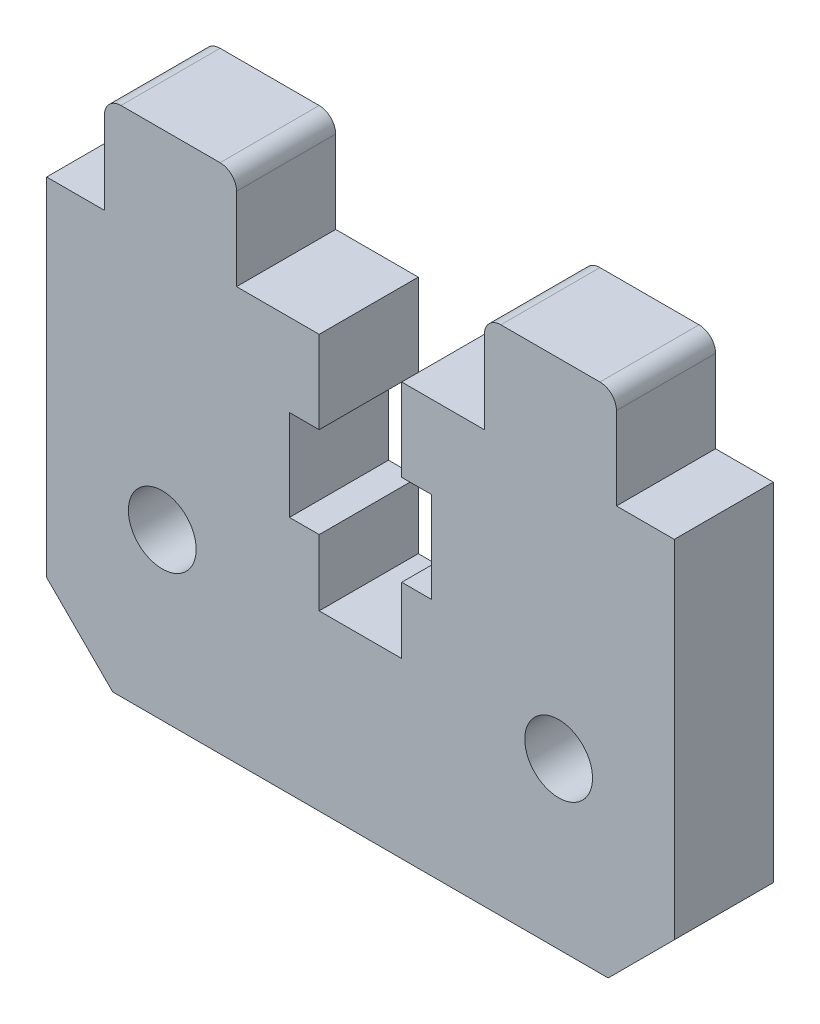
ISO-10303-21;
HEADER;
FILE_DESCRIPTION(('STEP AP214'),'2;1');
FILE_NAME('part.step','',(''),(''),'','','');
FILE_SCHEMA(('AUTOMOTIVE_DESIGN { 1 0 10303 214 1 1 1 1 }'));
ENDSEC;
DATA;
#1=APPLICATION_CONTEXT('core data for automotive mechanical design processes');
#2=APPLICATION_PROTOCOL_DEFINITION('international standard','automotive_design',2000,#1);
#3=PRODUCT_CONTEXT('',#1,'mechanical');
#4=PRODUCT('Part','Part','',(#3));
#5=PRODUCT_RELATED_PRODUCT_CATEGORY('part','',(#4));
#6=PRODUCT_DEFINITION_FORMATION('','',#4);
#7=PRODUCT_DEFINITION_CONTEXT('part definition',#1,'design');
#8=PRODUCT_DEFINITION('design','',#6,#7);
#9=PRODUCT_DEFINITION_SHAPE('','',#8);
#10=(LENGTH_UNIT() NAMED_UNIT(*) SI_UNIT(.MILLI.,.METRE.));
#11=(NAMED_UNIT(*) PLANE_ANGLE_UNIT() SI_UNIT($,.RADIAN.));
#12=(NAMED_UNIT(*) SI_UNIT($,.STERADIAN.) SOLID_ANGLE_UNIT());
#13=UNCERTAINTY_MEASURE_WITH_UNIT(LENGTH_MEASURE(1.E-05),#10,'distance_accuracy_value','');
#14=(GEOMETRIC_REPRESENTATION_CONTEXT(3) GLOBAL_UNCERTAINTY_ASSIGNED_CONTEXT((#13)) GLOBAL_UNIT_ASSIGNED_CONTEXT((#10,
#11,#12)) REPRESENTATION_CONTEXT('',''));
#15=CARTESIAN_POINT('',(0.,0.,0.));
#16=DIRECTION('',(0.,0.,1.));
#17=DIRECTION('',(1.,0.,0.));
#18=AXIS2_PLACEMENT_3D('',#15,#16,#17);
#19=CARTESIAN_POINT('',(0.,0.,6.));
#20=DIRECTION('',(0.,0.,1.));
#21=DIRECTION('',(1.,0.,0.));
#22=AXIS2_PLACEMENT_3D('',#19,#20,#21);
#23=PLANE('',#22);
#24=DIRECTION('',(1.,0.,0.));
#25=VECTOR('',#24,1.);
#26=CARTESIAN_POINT('',(-19.,-12.5,6.));
#27=LINE('',#26,#25);
#28=CARTESIAN_POINT('',(-15.,-12.5,6.));
#29=VERTEX_POINT('',#28);
#30=CARTESIAN_POINT('',(15.,-12.5,6.));
#31=VERTEX_POINT('',#30);
#32=EDGE_CURVE('E431',#29,#31,#27,.T.);
#33=ORIENTED_EDGE('',*,*,#32,.T.);
#34=DIRECTION('',(-0.707106781186548,-0.707106781186547,0.));
#35=VECTOR('',#34,1.);
#36=CARTESIAN_POINT('',(13.75,-13.75,6.));
#37=LINE('',#36,#35);
#38=CARTESIAN_POINT('',(19.,-8.50000000000001,6.));
#39=VERTEX_POINT('',#38);
#40=EDGE_CURVE('E42',#31,#39,#37,.F.);
#41=ORIENTED_EDGE('',*,*,#40,.T.);
#42=DIRECTION('',(0.,1.,0.));
#43=VECTOR('',#42,1.);
#44=CARTESIAN_POINT('',(19.,12.5,6.));
#45=LINE('',#44,#43);
#46=CARTESIAN_POINT('',(19.,12.5,6.));
#47=VERTEX_POINT('',#46);
#48=EDGE_CURVE('E420',#39,#47,#45,.T.);
#49=ORIENTED_EDGE('',*,*,#48,.T.);
#50=DIRECTION('',(-1.,0.,0.));
#51=VECTOR('',#50,1.);
#52=CARTESIAN_POINT('',(-19.,12.5,6.));
#53=LINE('',#52,#51);
#54=CARTESIAN_POINT('',(15.5,12.5,6.));
#55=VERTEX_POINT('',#54);
#56=EDGE_CURVE('E424',#47,#55,#53,.T.);
#57=ORIENTED_EDGE('',*,*,#56,.T.);
#58=DIRECTION('',(0.,1.,0.));
#59=VECTOR('',#58,1.);
#60=CARTESIAN_POINT('',(15.5,0.,6.));
#61=LINE('',#60,#59);
#62=CARTESIAN_POINT('',(15.5,17.5,6.));
#63=VERTEX_POINT('',#62);
#64=EDGE_CURVE('E263',#55,#63,#61,.T.);
#65=ORIENTED_EDGE('',*,*,#64,.T.);
#66=CARTESIAN_POINT('',(14.5,17.5,6.));
#67=DIRECTION('',(0.,0.,1.));
#68=DIRECTION('',(1.,0.,0.));
#69=AXIS2_PLACEMENT_3D('',#66,#67,#68);
#70=CIRCLE('',#69,1.);
#71=CARTESIAN_POINT('',(14.5,18.5,6.));
#72=VERTEX_POINT('',#71);
#73=EDGE_CURVE('E260',#63,#72,#70,.T.);
#74=ORIENTED_EDGE('',*,*,#73,.T.);
#75=DIRECTION('',(-1.,0.,0.));
#76=VECTOR('',#75,1.);
#77=CARTESIAN_POINT('',(0.,18.5,6.));
#78=LINE('',#77,#76);
#79=CARTESIAN_POINT('',(8.50000000000001,18.5,6.));
#80=VERTEX_POINT('',#79);
#81=EDGE_CURVE('E274',#72,#80,#78,.T.);
#82=ORIENTED_EDGE('',*,*,#81,.T.);
#83=CARTESIAN_POINT('',(8.50000000000001,17.5,6.));
#84=DIRECTION('',(0.,0.,1.));
#85=DIRECTION('',(1.,0.,0.));
#86=AXIS2_PLACEMENT_3D('',#83,#84,#85);
#87=CIRCLE('',#86,1.);
#88=CARTESIAN_POINT('',(7.50000000000001,17.5,6.));
#89=VERTEX_POINT('',#88);
#90=EDGE_CURVE('E238',#80,#89,#87,.T.);
#91=ORIENTED_EDGE('',*,*,#90,.T.);
#92=DIRECTION('',(0.,-1.,0.));
#93=VECTOR('',#92,1.);
#94=CARTESIAN_POINT('',(7.50000000000001,0.,6.));
#95=LINE('',#94,#93);
#96=CARTESIAN_POINT('',(7.50000000000001,12.5,6.));
#97=VERTEX_POINT('',#96);
#98=EDGE_CURVE('E278',#89,#97,#95,.T.);
#99=ORIENTED_EDGE('',*,*,#98,.T.);
#100=CARTESIAN_POINT('',(2.50000000000001,12.5,6.));
#101=VERTEX_POINT('',#100);
#102=EDGE_CURVE('E428',#97,#101,#53,.T.);
#103=ORIENTED_EDGE('',*,*,#102,.T.);
#104=DIRECTION('',(0.,-1.,0.));
#105=VECTOR('',#104,1.);
#106=CARTESIAN_POINT('',(2.50000000000001,0.,6.));
#107=LINE('',#106,#105);
#108=CARTESIAN_POINT('',(2.50000000000001,7.5,6.));
#109=VERTEX_POINT('',#108);
#110=EDGE_CURVE('E318',#101,#109,#107,.T.);
#111=ORIENTED_EDGE('',*,*,#110,.T.);
#112=DIRECTION('',(1.,0.,0.));
#113=VECTOR('',#112,1.);
#114=CARTESIAN_POINT('',(0.,7.5,6.));
#115=LINE('',#114,#113);
#116=CARTESIAN_POINT('',(4.30000000000001,7.5,6.));
#117=VERTEX_POINT('',#116);
#118=EDGE_CURVE('E336',#109,#117,#115,.T.);
#119=ORIENTED_EDGE('',*,*,#118,.T.);
#120=DIRECTION('',(0.,-1.,0.));
#121=VECTOR('',#120,1.);
#122=CARTESIAN_POINT('',(4.30000000000001,0.,6.));
#123=LINE('',#122,#121);
#124=CARTESIAN_POINT('',(4.30000000000001,2.,6.));
#125=VERTEX_POINT('',#124);
#126=EDGE_CURVE('E389',#117,#125,#123,.T.);
#127=ORIENTED_EDGE('',*,*,#126,.T.);
#128=DIRECTION('',(-1.,0.,0.));
#129=VECTOR('',#128,1.);
#130=CARTESIAN_POINT('',(0.,2.,6.));
#131=LINE('',#130,#129);
#132=CARTESIAN_POINT('',(2.5,2.,6.));
#133=VERTEX_POINT('',#132);
#134=EDGE_CURVE('E386',#125,#133,#131,.T.);
#135=ORIENTED_EDGE('',*,*,#134,.T.);
#136=DIRECTION('',(0.,-1.,0.));
#137=VECTOR('',#136,1.);
#138=CARTESIAN_POINT('',(2.5,0.,6.));
#139=LINE('',#138,#137);
#140=CARTESIAN_POINT('',(2.5,-2.,6.));
#141=VERTEX_POINT('',#140);
#142=EDGE_CURVE('E383',#133,#141,#139,.T.);
#143=ORIENTED_EDGE('',*,*,#142,.T.);
#144=DIRECTION('',(1.,0.,0.));
#145=VECTOR('',#144,1.);
#146=CARTESIAN_POINT('',(0.,-2.,6.));
#147=LINE('',#146,#145);
#148=CARTESIAN_POINT('',(-2.5,-2.,6.));
#149=VERTEX_POINT('',#148);
#150=EDGE_CURVE('E380',#149,#141,#147,.T.);
#151=ORIENTED_EDGE('',*,*,#150,.F.);
#152=DIRECTION('',(0.,-1.,0.));
#153=VECTOR('',#152,1.);
#154=CARTESIAN_POINT('',(-2.5,0.,6.));
#155=LINE('',#154,#153);
#156=CARTESIAN_POINT('',(-2.5,2.,6.));
#157=VERTEX_POINT('',#156);
#158=EDGE_CURVE('E377',#157,#149,#155,.T.);
#159=ORIENTED_EDGE('',*,*,#158,.F.);
#160=DIRECTION('',(1.,0.,0.));
#161=VECTOR('',#160,1.);
#162=CARTESIAN_POINT('',(0.,2.,6.));
#163=LINE('',#162,#161);
#164=CARTESIAN_POINT('',(-4.3,2.,6.));
#165=VERTEX_POINT('',#164);
#166=EDGE_CURVE('E374',#165,#157,#163,.T.);
#167=ORIENTED_EDGE('',*,*,#166,.F.);
#168=DIRECTION('',(0.,-1.,0.));
#169=VECTOR('',#168,1.);
#170=CARTESIAN_POINT('',(-4.3,0.,6.));
#171=LINE('',#170,#169);
#172=CARTESIAN_POINT('',(-4.3,7.5,6.));
#173=VERTEX_POINT('',#172);
#174=EDGE_CURVE('E371',#173,#165,#171,.T.);
#175=ORIENTED_EDGE('',*,*,#174,.F.);
#176=DIRECTION('',(-1.,0.,0.));
#177=VECTOR('',#176,1.);
#178=CARTESIAN_POINT('',(0.,7.5,6.));
#179=LINE('',#178,#177);
#180=CARTESIAN_POINT('',(-2.5,7.5,6.));
#181=VERTEX_POINT('',#180);
#182=EDGE_CURVE('E368',#181,#173,#179,.T.);
#183=ORIENTED_EDGE('',*,*,#182,.F.);
#184=DIRECTION('',(0.,-1.,0.));
#185=VECTOR('',#184,1.);
#186=CARTESIAN_POINT('',(-2.5,0.,6.));
#187=LINE('',#186,#185);
#188=CARTESIAN_POINT('',(-2.5,12.5,6.));
#189=VERTEX_POINT('',#188);
#190=EDGE_CURVE('E365',#189,#181,#187,.T.);
#191=ORIENTED_EDGE('',*,*,#190,.F.);
#192=CARTESIAN_POINT('',(-7.5,12.5,6.));
#193=VERTEX_POINT('',#192);
#194=EDGE_CURVE('E429',#189,#193,#53,.T.);
#195=ORIENTED_EDGE('',*,*,#194,.T.);
#196=DIRECTION('',(0.,-1.,0.));
#197=VECTOR('',#196,1.);
#198=CARTESIAN_POINT('',(-7.5,0.,6.));
#199=LINE('',#198,#197);
#200=CARTESIAN_POINT('',(-7.5,17.5,6.));
#201=VERTEX_POINT('',#200);
#202=EDGE_CURVE('E310',#201,#193,#199,.T.);
#203=ORIENTED_EDGE('',*,*,#202,.F.);
#204=CARTESIAN_POINT('',(-8.5,17.5,6.));
#205=DIRECTION('',(0.,0.,1.));
#206=DIRECTION('',(1.,0.,0.));
#207=AXIS2_PLACEMENT_3D('',#204,#205,#206);
#208=CIRCLE('',#207,1.);
#209=CARTESIAN_POINT('',(-8.5,18.5,6.));
#210=VERTEX_POINT('',#209);
#211=EDGE_CURVE('E312',#210,#201,#208,.F.);
#212=ORIENTED_EDGE('',*,*,#211,.F.);
#213=DIRECTION('',(1.,0.,0.));
#214=VECTOR('',#213,1.);
#215=CARTESIAN_POINT('',(0.,18.5,6.));
#216=LINE('',#215,#214);
#217=CARTESIAN_POINT('',(-14.5,18.5,6.));
#218=VERTEX_POINT('',#217);
#219=EDGE_CURVE('E297',#218,#210,#216,.T.);
#220=ORIENTED_EDGE('',*,*,#219,.F.);
#221=CARTESIAN_POINT('',(-14.5,17.5,6.));
#222=DIRECTION('',(0.,0.,1.));
#223=DIRECTION('',(1.,0.,0.));
#224=AXIS2_PLACEMENT_3D('',#221,#222,#223);
#225=CIRCLE('',#224,1.);
#226=CARTESIAN_POINT('',(-15.5,17.5,6.));
#227=VERTEX_POINT('',#226);
#228=EDGE_CURVE('E284',#227,#218,#225,.F.);
#229=ORIENTED_EDGE('',*,*,#228,.F.);
#230=DIRECTION('',(0.,1.,0.));
#231=VECTOR('',#230,1.);
#232=CARTESIAN_POINT('',(-15.5,0.,6.));
#233=LINE('',#232,#231);
#234=CARTESIAN_POINT('',(-15.5,12.5,6.));
#235=VERTEX_POINT('',#234);
#236=EDGE_CURVE('E308',#235,#227,#233,.T.);
#237=ORIENTED_EDGE('',*,*,#236,.F.);
#238=CARTESIAN_POINT('',(-19.,12.5,6.));
#239=VERTEX_POINT('',#238);
#240=EDGE_CURVE('E422',#235,#239,#53,.T.);
#241=ORIENTED_EDGE('',*,*,#240,.T.);
#242=DIRECTION('',(0.,-1.,0.));
#243=VECTOR('',#242,1.);
#244=CARTESIAN_POINT('',(-19.,12.5,6.));
#245=LINE('',#244,#243);
#246=CARTESIAN_POINT('',(-19.,-8.49999999999998,6.));
#247=VERTEX_POINT('',#246);
#248=EDGE_CURVE('E427',#239,#247,#245,.T.);
#249=ORIENTED_EDGE('',*,*,#248,.T.);
#250=DIRECTION('',(-0.707106781186546,0.707106781186549,0.));
#251=VECTOR('',#250,1.);
#252=CARTESIAN_POINT('',(-13.75,-13.75,6.));
#253=LINE('',#252,#251);
#254=EDGE_CURVE('E459',#247,#29,#253,.F.);
#255=ORIENTED_EDGE('',*,*,#254,.T.);
#256=EDGE_LOOP('',(#33,#41,#49,#57,#65,#74,#82,#91,#99,#103,#111,#119,#127,#135,#143,#151,#159,
#167,#175,#183,#191,#195,#203,#212,#220,#229,#237,#241,#249,#255));
#257=FACE_BOUND('',#256,.T.);
#258=CARTESIAN_POINT('',(-12.,-2.5,6.));
#259=DIRECTION('',(0.,0.,1.));
#260=DIRECTION('',(1.,0.,0.));
#261=AXIS2_PLACEMENT_3D('',#258,#259,#260);
#262=CIRCLE('',#261,2.05237610245136);
#263=CARTESIAN_POINT('',(-9.94762389754864,-2.5,6.));
#264=VERTEX_POINT('',#263);
#265=EDGE_CURVE('E266',#264,#264,#262,.T.);
#266=ORIENTED_EDGE('',*,*,#265,.F.);
#267=EDGE_LOOP('',(#266));
#268=FACE_BOUND('',#267,.T.);
#269=CARTESIAN_POINT('',(12.,-2.5,6.));
#270=DIRECTION('',(0.,0.,-1.));
#271=DIRECTION('',(-1.,0.,0.));
#272=AXIS2_PLACEMENT_3D('',#269,#270,#271);
#273=CIRCLE('',#272,2.05237610245136);
#274=CARTESIAN_POINT('',(9.94762389754864,-2.5,6.));
#275=VERTEX_POINT('',#274);
#276=EDGE_CURVE('E866',#275,#275,#273,.T.);
#277=ORIENTED_EDGE('',*,*,#276,.T.);
#278=EDGE_LOOP('',(#277));
#279=FACE_BOUND('',#278,.T.);
#280=ADVANCED_FACE('F34',(#257,#268,#279),#23,.T.);
#281=CARTESIAN_POINT('',(0.,0.,0.));
#282=DIRECTION('',(0.,0.,1.));
#283=DIRECTION('',(1.,0.,0.));
#284=AXIS2_PLACEMENT_3D('',#281,#282,#283);
#285=PLANE('',#284);
#286=DIRECTION('',(0.,1.,0.));
#287=VECTOR('',#286,1.);
#288=CARTESIAN_POINT('',(19.,12.5,0.));
#289=LINE('',#288,#287);
#290=CARTESIAN_POINT('',(19.,-8.5,0.));
#291=VERTEX_POINT('',#290);
#292=CARTESIAN_POINT('',(19.,12.5,0.));
#293=VERTEX_POINT('',#292);
#294=EDGE_CURVE('E397',#291,#293,#289,.T.);
#295=ORIENTED_EDGE('',*,*,#294,.F.);
#296=DIRECTION('',(0.707106781186548,0.707106781186547,0.));
#297=VECTOR('',#296,1.);
#298=CARTESIAN_POINT('',(19.,-8.5,0.));
#299=LINE('',#298,#297);
#300=CARTESIAN_POINT('',(15.,-12.5,0.));
#301=VERTEX_POINT('',#300);
#302=EDGE_CURVE('E453',#291,#301,#299,.F.);
#303=ORIENTED_EDGE('',*,*,#302,.T.);
#304=DIRECTION('',(1.,0.,0.));
#305=VECTOR('',#304,1.);
#306=CARTESIAN_POINT('',(-19.,-12.5,0.));
#307=LINE('',#306,#305);
#308=CARTESIAN_POINT('',(-15.,-12.5,0.));
#309=VERTEX_POINT('',#308);
#310=EDGE_CURVE('E423',#309,#301,#307,.T.);
#311=ORIENTED_EDGE('',*,*,#310,.F.);
#312=DIRECTION('',(0.707106781186546,-0.707106781186549,0.));
#313=VECTOR('',#312,1.);
#314=CARTESIAN_POINT('',(-15.,-12.5,0.));
#315=LINE('',#314,#313);
#316=CARTESIAN_POINT('',(-19.,-8.49999999999999,0.));
#317=VERTEX_POINT('',#316);
#318=EDGE_CURVE('E451',#309,#317,#315,.F.);
#319=ORIENTED_EDGE('',*,*,#318,.T.);
#320=DIRECTION('',(0.,-1.,0.));
#321=VECTOR('',#320,1.);
#322=CARTESIAN_POINT('',(-19.,12.5,0.));
#323=LINE('',#322,#321);
#324=CARTESIAN_POINT('',(-19.,12.5,0.));
#325=VERTEX_POINT('',#324);
#326=EDGE_CURVE('E438',#325,#317,#323,.T.);
#327=ORIENTED_EDGE('',*,*,#326,.F.);
#328=DIRECTION('',(-1.,0.,0.));
#329=VECTOR('',#328,1.);
#330=CARTESIAN_POINT('',(-19.,12.5,0.));
#331=LINE('',#330,#329);
#332=CARTESIAN_POINT('',(-15.5,12.5,0.));
#333=VERTEX_POINT('',#332);
#334=EDGE_CURVE('E435',#333,#325,#331,.T.);
#335=ORIENTED_EDGE('',*,*,#334,.F.);
#336=DIRECTION('',(0.,1.,0.));
#337=VECTOR('',#336,1.);
#338=CARTESIAN_POINT('',(-15.5,0.,0.));
#339=LINE('',#338,#337);
#340=CARTESIAN_POINT('',(-15.5,17.5,0.));
#341=VERTEX_POINT('',#340);
#342=EDGE_CURVE('E296',#333,#341,#339,.T.);
#343=ORIENTED_EDGE('',*,*,#342,.T.);
#344=CARTESIAN_POINT('',(-14.5,17.5,0.));
#345=DIRECTION('',(0.,0.,1.));
#346=DIRECTION('',(1.,0.,0.));
#347=AXIS2_PLACEMENT_3D('',#344,#345,#346);
#348=CIRCLE('',#347,1.);
#349=CARTESIAN_POINT('',(-14.5,18.5,0.));
#350=VERTEX_POINT('',#349);
#351=EDGE_CURVE('E293',#341,#350,#348,.F.);
#352=ORIENTED_EDGE('',*,*,#351,.T.);
#353=DIRECTION('',(1.,0.,0.));
#354=VECTOR('',#353,1.);
#355=CARTESIAN_POINT('',(0.,18.5,0.));
#356=LINE('',#355,#354);
#357=CARTESIAN_POINT('',(-8.5,18.5,0.));
#358=VERTEX_POINT('',#357);
#359=EDGE_CURVE('E303',#350,#358,#356,.T.);
#360=ORIENTED_EDGE('',*,*,#359,.T.);
#361=CARTESIAN_POINT('',(-8.5,17.5,0.));
#362=DIRECTION('',(0.,0.,1.));
#363=DIRECTION('',(1.,0.,0.));
#364=AXIS2_PLACEMENT_3D('',#361,#362,#363);
#365=CIRCLE('',#364,1.);
#366=CARTESIAN_POINT('',(-7.5,17.5,0.));
#367=VERTEX_POINT('',#366);
#368=EDGE_CURVE('E301',#358,#367,#365,.F.);
#369=ORIENTED_EDGE('',*,*,#368,.T.);
#370=DIRECTION('',(0.,-1.,0.));
#371=VECTOR('',#370,1.);
#372=CARTESIAN_POINT('',(-7.5,0.,0.));
#373=LINE('',#372,#371);
#374=CARTESIAN_POINT('',(-7.5,12.5,0.));
#375=VERTEX_POINT('',#374);
#376=EDGE_CURVE('E299',#367,#375,#373,.T.);
#377=ORIENTED_EDGE('',*,*,#376,.T.);
#378=CARTESIAN_POINT('',(-2.5,12.5,0.));
#379=VERTEX_POINT('',#378);
#380=EDGE_CURVE('E440',#379,#375,#331,.T.);
#381=ORIENTED_EDGE('',*,*,#380,.F.);
#382=DIRECTION('',(0.,-1.,0.));
#383=VECTOR('',#382,1.);
#384=CARTESIAN_POINT('',(-2.5,0.,0.));
#385=LINE('',#384,#383);
#386=CARTESIAN_POINT('',(-2.5,7.5,0.));
#387=VERTEX_POINT('',#386);
#388=EDGE_CURVE('E335',#379,#387,#385,.T.);
#389=ORIENTED_EDGE('',*,*,#388,.T.);
#390=DIRECTION('',(-1.,0.,0.));
#391=VECTOR('',#390,1.);
#392=CARTESIAN_POINT('',(0.,7.5,0.));
#393=LINE('',#392,#391);
#394=CARTESIAN_POINT('',(-4.3,7.5,0.));
#395=VERTEX_POINT('',#394);
#396=EDGE_CURVE('E339',#387,#395,#393,.T.);
#397=ORIENTED_EDGE('',*,*,#396,.T.);
#398=DIRECTION('',(0.,-1.,0.));
#399=VECTOR('',#398,1.);
#400=CARTESIAN_POINT('',(-4.3,0.,0.));
#401=LINE('',#400,#399);
#402=CARTESIAN_POINT('',(-4.3,2.,0.));
#403=VERTEX_POINT('',#402);
#404=EDGE_CURVE('E342',#395,#403,#401,.T.);
#405=ORIENTED_EDGE('',*,*,#404,.T.);
#406=DIRECTION('',(1.,0.,0.));
#407=VECTOR('',#406,1.);
#408=CARTESIAN_POINT('',(0.,2.,0.));
#409=LINE('',#408,#407);
#410=CARTESIAN_POINT('',(-2.5,2.,0.));
#411=VERTEX_POINT('',#410);
#412=EDGE_CURVE('E345',#403,#411,#409,.T.);
#413=ORIENTED_EDGE('',*,*,#412,.T.);
#414=DIRECTION('',(0.,-1.,0.));
#415=VECTOR('',#414,1.);
#416=CARTESIAN_POINT('',(-2.5,0.,0.));
#417=LINE('',#416,#415);
#418=CARTESIAN_POINT('',(-2.5,-2.,0.));
#419=VERTEX_POINT('',#418);
#420=EDGE_CURVE('E348',#411,#419,#417,.T.);
#421=ORIENTED_EDGE('',*,*,#420,.T.);
#422=DIRECTION('',(1.,0.,0.));
#423=VECTOR('',#422,1.);
#424=CARTESIAN_POINT('',(0.,-2.,0.));
#425=LINE('',#424,#423);
#426=CARTESIAN_POINT('',(2.5,-2.,0.));
#427=VERTEX_POINT('',#426);
#428=EDGE_CURVE('E351',#419,#427,#425,.T.);
#429=ORIENTED_EDGE('',*,*,#428,.T.);
#430=DIRECTION('',(0.,-1.,0.));
#431=VECTOR('',#430,1.);
#432=CARTESIAN_POINT('',(2.5,0.,0.));
#433=LINE('',#432,#431);
#434=CARTESIAN_POINT('',(2.5,2.,0.));
#435=VERTEX_POINT('',#434);
#436=EDGE_CURVE('E354',#435,#427,#433,.T.);
#437=ORIENTED_EDGE('',*,*,#436,.F.);
#438=DIRECTION('',(-1.,0.,0.));
#439=VECTOR('',#438,1.);
#440=CARTESIAN_POINT('',(0.,2.,0.));
#441=LINE('',#440,#439);
#442=CARTESIAN_POINT('',(4.30000000000001,2.,0.));
#443=VERTEX_POINT('',#442);
#444=EDGE_CURVE('E356',#443,#435,#441,.T.);
#445=ORIENTED_EDGE('',*,*,#444,.F.);
#446=DIRECTION('',(0.,-1.,0.));
#447=VECTOR('',#446,1.);
#448=CARTESIAN_POINT('',(4.30000000000001,0.,0.));
#449=LINE('',#448,#447);
#450=CARTESIAN_POINT('',(4.30000000000001,7.5,0.));
#451=VERTEX_POINT('',#450);
#452=EDGE_CURVE('E358',#451,#443,#449,.T.);
#453=ORIENTED_EDGE('',*,*,#452,.F.);
#454=DIRECTION('',(1.,0.,0.));
#455=VECTOR('',#454,1.);
#456=CARTESIAN_POINT('',(0.,7.5,0.));
#457=LINE('',#456,#455);
#458=CARTESIAN_POINT('',(2.50000000000001,7.5,0.));
#459=VERTEX_POINT('',#458);
#460=EDGE_CURVE('E360',#459,#451,#457,.T.);
#461=ORIENTED_EDGE('',*,*,#460,.F.);
#462=DIRECTION('',(0.,-1.,0.));
#463=VECTOR('',#462,1.);
#464=CARTESIAN_POINT('',(2.50000000000001,0.,0.));
#465=LINE('',#464,#463);
#466=CARTESIAN_POINT('',(2.50000000000001,12.5,0.));
#467=VERTEX_POINT('',#466);
#468=EDGE_CURVE('E333',#467,#459,#465,.T.);
#469=ORIENTED_EDGE('',*,*,#468,.F.);
#470=CARTESIAN_POINT('',(7.50000000000001,12.5,0.));
#471=VERTEX_POINT('',#470);
#472=EDGE_CURVE('E439',#471,#467,#331,.T.);
#473=ORIENTED_EDGE('',*,*,#472,.F.);
#474=DIRECTION('',(0.,-1.,0.));
#475=VECTOR('',#474,1.);
#476=CARTESIAN_POINT('',(7.50000000000001,0.,0.));
#477=LINE('',#476,#475);
#478=CARTESIAN_POINT('',(7.50000000000001,17.5,0.));
#479=VERTEX_POINT('',#478);
#480=EDGE_CURVE('E256',#479,#471,#477,.T.);
#481=ORIENTED_EDGE('',*,*,#480,.F.);
#482=CARTESIAN_POINT('',(8.50000000000001,17.5,0.));
#483=DIRECTION('',(0.,0.,1.));
#484=DIRECTION('',(1.,0.,0.));
#485=AXIS2_PLACEMENT_3D('',#482,#483,#484);
#486=CIRCLE('',#485,1.);
#487=CARTESIAN_POINT('',(8.50000000000001,18.5,0.));
#488=VERTEX_POINT('',#487);
#489=EDGE_CURVE('E236',#488,#479,#486,.T.);
#490=ORIENTED_EDGE('',*,*,#489,.F.);
#491=DIRECTION('',(-1.,0.,0.));
#492=VECTOR('',#491,1.);
#493=CARTESIAN_POINT('',(0.,18.5,0.));
#494=LINE('',#493,#492);
#495=CARTESIAN_POINT('',(14.5,18.5,0.));
#496=VERTEX_POINT('',#495);
#497=EDGE_CURVE('E253',#496,#488,#494,.T.);
#498=ORIENTED_EDGE('',*,*,#497,.F.);
#499=CARTESIAN_POINT('',(14.5,17.5,0.));
#500=DIRECTION('',(0.,0.,1.));
#501=DIRECTION('',(1.,0.,0.));
#502=AXIS2_PLACEMENT_3D('',#499,#500,#501);
#503=CIRCLE('',#502,1.);
#504=CARTESIAN_POINT('',(15.5,17.5,0.));
#505=VERTEX_POINT('',#504);
#506=EDGE_CURVE('E244',#505,#496,#503,.T.);
#507=ORIENTED_EDGE('',*,*,#506,.F.);
#508=DIRECTION('',(0.,1.,0.));
#509=VECTOR('',#508,1.);
#510=CARTESIAN_POINT('',(15.5,0.,0.));
#511=LINE('',#510,#509);
#512=CARTESIAN_POINT('',(15.5,12.5,0.));
#513=VERTEX_POINT('',#512);
#514=EDGE_CURVE('E270',#513,#505,#511,.T.);
#515=ORIENTED_EDGE('',*,*,#514,.F.);
#516=EDGE_CURVE('E436',#293,#513,#331,.T.);
#517=ORIENTED_EDGE('',*,*,#516,.F.);
#518=EDGE_LOOP('',(#295,#303,#311,#319,#327,#335,#343,#352,#360,#369,#377,#381,#389,#397,#405,
#413,#421,#429,#437,#445,#453,#461,#469,#473,#481,#490,#498,#507,#515,#517));
#519=FACE_BOUND('',#518,.T.);
#520=CARTESIAN_POINT('',(-12.,-2.5,0.));
#521=DIRECTION('',(0.,0.,1.));
#522=DIRECTION('',(1.,0.,0.));
#523=AXIS2_PLACEMENT_3D('',#520,#521,#522);
#524=CIRCLE('',#523,2.05237610245136);
#525=CARTESIAN_POINT('',(-9.94762389754864,-2.5,0.));
#526=VERTEX_POINT('',#525);
#527=EDGE_CURVE('E276',#526,#526,#524,.T.);
#528=ORIENTED_EDGE('',*,*,#527,.T.);
#529=EDGE_LOOP('',(#528));
#530=FACE_BOUND('',#529,.T.);
#531=CARTESIAN_POINT('',(12.,-2.5,0.));
#532=DIRECTION('',(0.,0.,-1.));
#533=DIRECTION('',(-1.,0.,0.));
#534=AXIS2_PLACEMENT_3D('',#531,#532,#533);
#535=CIRCLE('',#534,2.05237610245136);
#536=CARTESIAN_POINT('',(9.94762389754864,-2.5,0.));
#537=VERTEX_POINT('',#536);
#538=EDGE_CURVE('E863',#537,#537,#535,.T.);
#539=ORIENTED_EDGE('',*,*,#538,.F.);
#540=EDGE_LOOP('',(#539));
#541=FACE_BOUND('',#540,.T.);
#542=ADVANCED_FACE('F250',(#519,#530,#541),#285,.F.);
#543=CARTESIAN_POINT('',(-19.,12.5,6.));
#544=DIRECTION('',(0.,-1.,0.));
#545=DIRECTION('',(0.,0.,-1.));
#546=AXIS2_PLACEMENT_3D('',#543,#544,#545);
#547=PLANE('',#546);
#548=ORIENTED_EDGE('',*,*,#516,.T.);
#549=DIRECTION('',(0.,0.,1.));
#550=VECTOR('',#549,1.);
#551=CARTESIAN_POINT('',(15.5,12.5,0.));
#552=LINE('',#551,#550);
#553=EDGE_CURVE('E287',#513,#55,#552,.T.);
#554=ORIENTED_EDGE('',*,*,#553,.T.);
#555=ORIENTED_EDGE('',*,*,#56,.F.);
#556=DIRECTION('',(0.,0.,-1.));
#557=VECTOR('',#556,1.);
#558=CARTESIAN_POINT('',(19.,12.5,6.));
#559=LINE('',#558,#557);
#560=EDGE_CURVE('E445',#47,#293,#559,.T.);
#561=ORIENTED_EDGE('',*,*,#560,.T.);
#562=EDGE_LOOP('',(#548,#554,#555,#561));
#563=FACE_BOUND('',#562,.T.);
#564=ADVANCED_FACE('F578',(#563),#547,.F.);
#565=DIRECTION('',(0.,0.,1.));
#566=VECTOR('',#565,1.);
#567=CARTESIAN_POINT('',(-7.5,12.5,0.));
#568=LINE('',#567,#566);
#569=EDGE_CURVE('E325',#375,#193,#568,.T.);
#570=ORIENTED_EDGE('',*,*,#569,.T.);
#571=ORIENTED_EDGE('',*,*,#194,.F.);
#572=DIRECTION('',(0.,0.,1.));
#573=VECTOR('',#572,1.);
#574=CARTESIAN_POINT('',(-2.5,12.5,0.));
#575=LINE('',#574,#573);
#576=EDGE_CURVE('E416',#379,#189,#575,.T.);
#577=ORIENTED_EDGE('',*,*,#576,.F.);
#578=ORIENTED_EDGE('',*,*,#380,.T.);
#579=EDGE_LOOP('',(#570,#571,#577,#578));
#580=FACE_BOUND('',#579,.T.);
#581=ADVANCED_FACE('F533',(#580),#547,.F.);
#582=DIRECTION('',(0.,0.,1.));
#583=VECTOR('',#582,1.);
#584=CARTESIAN_POINT('',(-15.5,12.5,0.));
#585=LINE('',#584,#583);
#586=EDGE_CURVE('E328',#333,#235,#585,.T.);
#587=ORIENTED_EDGE('',*,*,#586,.F.);
#588=ORIENTED_EDGE('',*,*,#334,.T.);
#589=DIRECTION('',(0.,0.,-1.));
#590=VECTOR('',#589,1.);
#591=CARTESIAN_POINT('',(-19.,12.5,6.));
#592=LINE('',#591,#590);
#593=EDGE_CURVE('E433',#239,#325,#592,.T.);
#594=ORIENTED_EDGE('',*,*,#593,.F.);
#595=ORIENTED_EDGE('',*,*,#240,.F.);
#596=EDGE_LOOP('',(#587,#588,#594,#595));
#597=FACE_BOUND('',#596,.T.);
#598=ADVANCED_FACE('F484',(#597),#547,.F.);
#599=ORIENTED_EDGE('',*,*,#102,.F.);
#600=DIRECTION('',(0.,0.,1.));
#601=VECTOR('',#600,1.);
#602=CARTESIAN_POINT('',(7.50000000000001,12.5,0.));
#603=LINE('',#602,#601);
#604=EDGE_CURVE('E289',#471,#97,#603,.T.);
#605=ORIENTED_EDGE('',*,*,#604,.F.);
#606=ORIENTED_EDGE('',*,*,#472,.T.);
#607=DIRECTION('',(0.,0.,1.));
#608=VECTOR('',#607,1.);
#609=CARTESIAN_POINT('',(2.50000000000001,12.5,0.));
#610=LINE('',#609,#608);
#611=EDGE_CURVE('E362',#467,#101,#610,.T.);
#612=ORIENTED_EDGE('',*,*,#611,.T.);
#613=EDGE_LOOP('',(#599,#605,#606,#612));
#614=FACE_BOUND('',#613,.T.);
#615=ADVANCED_FACE('F489',(#614),#547,.F.);
#616=CARTESIAN_POINT('',(19.,12.5,6.));
#617=DIRECTION('',(-1.,0.,0.));
#618=DIRECTION('',(0.,0.,1.));
#619=AXIS2_PLACEMENT_3D('',#616,#617,#618);
#620=PLANE('',#619);
#621=ORIENTED_EDGE('',*,*,#48,.F.);
#622=DIRECTION('',(0.,0.,-1.));
#623=VECTOR('',#622,1.);
#624=CARTESIAN_POINT('',(19.,-8.5,6.));
#625=LINE('',#624,#623);
#626=EDGE_CURVE('E448',#39,#291,#625,.T.);
#627=ORIENTED_EDGE('',*,*,#626,.T.);
#628=ORIENTED_EDGE('',*,*,#294,.T.);
#629=ORIENTED_EDGE('',*,*,#560,.F.);
#630=EDGE_LOOP('',(#621,#627,#628,#629));
#631=FACE_BOUND('',#630,.T.);
#632=ADVANCED_FACE('F469',(#631),#620,.F.);
#633=CARTESIAN_POINT('',(-19.,12.5,6.));
#634=DIRECTION('',(1.,0.,0.));
#635=DIRECTION('',(0.,1.,0.));
#636=AXIS2_PLACEMENT_3D('',#633,#634,#635);
#637=PLANE('',#636);
#638=ORIENTED_EDGE('',*,*,#326,.T.);
#639=DIRECTION('',(0.,0.,1.));
#640=VECTOR('',#639,1.);
#641=CARTESIAN_POINT('',(-19.,-8.49999999999999,6.));
#642=LINE('',#641,#640);
#643=EDGE_CURVE('E11',#317,#247,#642,.T.);
#644=ORIENTED_EDGE('',*,*,#643,.T.);
#645=ORIENTED_EDGE('',*,*,#248,.F.);
#646=ORIENTED_EDGE('',*,*,#593,.T.);
#647=EDGE_LOOP('',(#638,#644,#645,#646));
#648=FACE_BOUND('',#647,.T.);
#649=ADVANCED_FACE('F479',(#648),#637,.F.);
#650=CARTESIAN_POINT('',(-19.,-12.5,6.));
#651=DIRECTION('',(0.,1.,0.));
#652=DIRECTION('',(0.,0.,1.));
#653=AXIS2_PLACEMENT_3D('',#650,#651,#652);
#654=PLANE('',#653);
#655=ORIENTED_EDGE('',*,*,#310,.T.);
#656=DIRECTION('',(0.,0.,1.));
#657=VECTOR('',#656,1.);
#658=CARTESIAN_POINT('',(15.,-12.5,6.));
#659=LINE('',#658,#657);
#660=EDGE_CURVE('E55',#301,#31,#659,.T.);
#661=ORIENTED_EDGE('',*,*,#660,.T.);
#662=ORIENTED_EDGE('',*,*,#32,.F.);
#663=DIRECTION('',(0.,0.,-1.));
#664=VECTOR('',#663,1.);
#665=CARTESIAN_POINT('',(-15.,-12.5,6.));
#666=LINE('',#665,#664);
#667=EDGE_CURVE('E455',#29,#309,#666,.T.);
#668=ORIENTED_EDGE('',*,*,#667,.T.);
#669=EDGE_LOOP('',(#655,#661,#662,#668));
#670=FACE_BOUND('',#669,.T.);
#671=ADVANCED_FACE('F473',(#670),#654,.F.);
#672=CARTESIAN_POINT('',(2.50000000000001,0.,0.));
#673=DIRECTION('',(-1.,0.,0.));
#674=DIRECTION('',(0.,0.,1.));
#675=AXIS2_PLACEMENT_3D('',#672,#673,#674);
#676=PLANE('',#675);
#677=ORIENTED_EDGE('',*,*,#110,.F.);
#678=ORIENTED_EDGE('',*,*,#611,.F.);
#679=ORIENTED_EDGE('',*,*,#468,.T.);
#680=DIRECTION('',(0.,0.,1.));
#681=VECTOR('',#680,1.);
#682=CARTESIAN_POINT('',(2.50000000000001,7.5,0.));
#683=LINE('',#682,#681);
#684=EDGE_CURVE('E394',#459,#109,#683,.T.);
#685=ORIENTED_EDGE('',*,*,#684,.T.);
#686=EDGE_LOOP('',(#677,#678,#679,#685));
#687=FACE_BOUND('',#686,.T.);
#688=ADVANCED_FACE('F493',(#687),#676,.T.);
#689=CARTESIAN_POINT('',(0.,7.5,0.));
#690=DIRECTION('',(0.,-1.,0.));
#691=DIRECTION('',(0.,0.,-1.));
#692=AXIS2_PLACEMENT_3D('',#689,#690,#691);
#693=PLANE('',#692);
#694=ORIENTED_EDGE('',*,*,#118,.F.);
#695=ORIENTED_EDGE('',*,*,#684,.F.);
#696=ORIENTED_EDGE('',*,*,#460,.T.);
#697=DIRECTION('',(0.,0.,1.));
#698=VECTOR('',#697,1.);
#699=CARTESIAN_POINT('',(4.30000000000001,7.5,0.));
#700=LINE('',#699,#698);
#701=EDGE_CURVE('E398',#451,#117,#700,.T.);
#702=ORIENTED_EDGE('',*,*,#701,.T.);
#703=EDGE_LOOP('',(#694,#695,#696,#702));
#704=FACE_BOUND('',#703,.T.);
#705=ADVANCED_FACE('F500',(#704),#693,.T.);
#706=CARTESIAN_POINT('',(4.30000000000001,0.,0.));
#707=DIRECTION('',(-1.,0.,0.));
#708=DIRECTION('',(0.,0.,1.));
#709=AXIS2_PLACEMENT_3D('',#706,#707,#708);
#710=PLANE('',#709);
#711=ORIENTED_EDGE('',*,*,#126,.F.);
#712=ORIENTED_EDGE('',*,*,#701,.F.);
#713=ORIENTED_EDGE('',*,*,#452,.T.);
#714=DIRECTION('',(0.,0.,1.));
#715=VECTOR('',#714,1.);
#716=CARTESIAN_POINT('',(4.30000000000001,2.,0.));
#717=LINE('',#716,#715);
#718=EDGE_CURVE('E400',#443,#125,#717,.T.);
#719=ORIENTED_EDGE('',*,*,#718,.T.);
#720=EDGE_LOOP('',(#711,#712,#713,#719));
#721=FACE_BOUND('',#720,.T.);
#722=ADVANCED_FACE('F503',(#721),#710,.T.);
#723=CARTESIAN_POINT('',(0.,2.,0.));
#724=DIRECTION('',(0.,1.,0.));
#725=DIRECTION('',(-1.,0.,0.));
#726=AXIS2_PLACEMENT_3D('',#723,#724,#725);
#727=PLANE('',#726);
#728=ORIENTED_EDGE('',*,*,#134,.F.);
#729=ORIENTED_EDGE('',*,*,#718,.F.);
#730=ORIENTED_EDGE('',*,*,#444,.T.);
#731=DIRECTION('',(0.,0.,1.));
#732=VECTOR('',#731,1.);
#733=CARTESIAN_POINT('',(2.5,2.,0.));
#734=LINE('',#733,#732);
#735=EDGE_CURVE('E402',#435,#133,#734,.T.);
#736=ORIENTED_EDGE('',*,*,#735,.T.);
#737=EDGE_LOOP('',(#728,#729,#730,#736));
#738=FACE_BOUND('',#737,.T.);
#739=ADVANCED_FACE('F564',(#738),#727,.T.);
#740=CARTESIAN_POINT('',(2.5,0.,0.));
#741=DIRECTION('',(-1.,0.,0.));
#742=DIRECTION('',(0.,0.,1.));
#743=AXIS2_PLACEMENT_3D('',#740,#741,#742);
#744=PLANE('',#743);
#745=ORIENTED_EDGE('',*,*,#142,.F.);
#746=ORIENTED_EDGE('',*,*,#735,.F.);
#747=ORIENTED_EDGE('',*,*,#436,.T.);
#748=DIRECTION('',(0.,0.,1.));
#749=VECTOR('',#748,1.);
#750=CARTESIAN_POINT('',(2.5,-2.,0.));
#751=LINE('',#750,#749);
#752=EDGE_CURVE('E404',#427,#141,#751,.T.);
#753=ORIENTED_EDGE('',*,*,#752,.T.);
#754=EDGE_LOOP('',(#745,#746,#747,#753));
#755=FACE_BOUND('',#754,.T.);
#756=ADVANCED_FACE('F561',(#755),#744,.T.);
#757=CARTESIAN_POINT('',(0.,-2.,0.));
#758=DIRECTION('',(0.,-1.,0.));
#759=DIRECTION('',(0.,0.,-1.));
#760=AXIS2_PLACEMENT_3D('',#757,#758,#759);
#761=PLANE('',#760);
#762=ORIENTED_EDGE('',*,*,#150,.T.);
#763=ORIENTED_EDGE('',*,*,#752,.F.);
#764=ORIENTED_EDGE('',*,*,#428,.F.);
#765=DIRECTION('',(0.,0.,1.));
#766=VECTOR('',#765,1.);
#767=CARTESIAN_POINT('',(-2.5,-2.,0.));
#768=LINE('',#767,#766);
#769=EDGE_CURVE('E406',#419,#149,#768,.T.);
#770=ORIENTED_EDGE('',*,*,#769,.T.);
#771=EDGE_LOOP('',(#762,#763,#764,#770));
#772=FACE_BOUND('',#771,.T.);
#773=ADVANCED_FACE('F557',(#772),#761,.F.);
#774=CARTESIAN_POINT('',(-2.5,0.,0.));
#775=DIRECTION('',(-1.,0.,0.));
#776=DIRECTION('',(0.,0.,1.));
#777=AXIS2_PLACEMENT_3D('',#774,#775,#776);
#778=PLANE('',#777);
#779=ORIENTED_EDGE('',*,*,#158,.T.);
#780=ORIENTED_EDGE('',*,*,#769,.F.);
#781=ORIENTED_EDGE('',*,*,#420,.F.);
#782=DIRECTION('',(0.,0.,1.));
#783=VECTOR('',#782,1.);
#784=CARTESIAN_POINT('',(-2.5,2.,0.));
#785=LINE('',#784,#783);
#786=EDGE_CURVE('E408',#411,#157,#785,.T.);
#787=ORIENTED_EDGE('',*,*,#786,.T.);
#788=EDGE_LOOP('',(#779,#780,#781,#787));
#789=FACE_BOUND('',#788,.T.);
#790=ADVANCED_FACE('F552',(#789),#778,.F.);
#791=CARTESIAN_POINT('',(0.,2.,0.));
#792=DIRECTION('',(0.,-1.,0.));
#793=DIRECTION('',(1.,0.,0.));
#794=AXIS2_PLACEMENT_3D('',#791,#792,#793);
#795=PLANE('',#794);
#796=ORIENTED_EDGE('',*,*,#166,.T.);
#797=ORIENTED_EDGE('',*,*,#786,.F.);
#798=ORIENTED_EDGE('',*,*,#412,.F.);
#799=DIRECTION('',(0.,0.,1.));
#800=VECTOR('',#799,1.);
#801=CARTESIAN_POINT('',(-4.3,2.,0.));
#802=LINE('',#801,#800);
#803=EDGE_CURVE('E410',#403,#165,#802,.T.);
#804=ORIENTED_EDGE('',*,*,#803,.T.);
#805=EDGE_LOOP('',(#796,#797,#798,#804));
#806=FACE_BOUND('',#805,.T.);
#807=ADVANCED_FACE('F548',(#806),#795,.F.);
#808=CARTESIAN_POINT('',(-4.3,0.,0.));
#809=DIRECTION('',(-1.,0.,0.));
#810=DIRECTION('',(0.,-1.,0.));
#811=AXIS2_PLACEMENT_3D('',#808,#809,#810);
#812=PLANE('',#811);
#813=ORIENTED_EDGE('',*,*,#174,.T.);
#814=ORIENTED_EDGE('',*,*,#803,.F.);
#815=ORIENTED_EDGE('',*,*,#404,.F.);
#816=DIRECTION('',(0.,0.,1.));
#817=VECTOR('',#816,1.);
#818=CARTESIAN_POINT('',(-4.3,7.5,0.));
#819=LINE('',#818,#817);
#820=EDGE_CURVE('E412',#395,#173,#819,.T.);
#821=ORIENTED_EDGE('',*,*,#820,.T.);
#822=EDGE_LOOP('',(#813,#814,#815,#821));
#823=FACE_BOUND('',#822,.T.);
#824=ADVANCED_FACE('F546',(#823),#812,.F.);
#825=CARTESIAN_POINT('',(0.,7.5,0.));
#826=DIRECTION('',(0.,1.,0.));
#827=DIRECTION('',(0.,0.,1.));
#828=AXIS2_PLACEMENT_3D('',#825,#826,#827);
#829=PLANE('',#828);
#830=ORIENTED_EDGE('',*,*,#182,.T.);
#831=ORIENTED_EDGE('',*,*,#820,.F.);
#832=ORIENTED_EDGE('',*,*,#396,.F.);
#833=DIRECTION('',(0.,0.,1.));
#834=VECTOR('',#833,1.);
#835=CARTESIAN_POINT('',(-2.5,7.5,0.));
#836=LINE('',#835,#834);
#837=EDGE_CURVE('E414',#387,#181,#836,.T.);
#838=ORIENTED_EDGE('',*,*,#837,.T.);
#839=EDGE_LOOP('',(#830,#831,#832,#838));
#840=FACE_BOUND('',#839,.T.);
#841=ADVANCED_FACE('F542',(#840),#829,.F.);
#842=CARTESIAN_POINT('',(-2.5,0.,0.));
#843=DIRECTION('',(-1.,0.,0.));
#844=DIRECTION('',(0.,0.,1.));
#845=AXIS2_PLACEMENT_3D('',#842,#843,#844);
#846=PLANE('',#845);
#847=ORIENTED_EDGE('',*,*,#190,.T.);
#848=ORIENTED_EDGE('',*,*,#837,.F.);
#849=ORIENTED_EDGE('',*,*,#388,.F.);
#850=ORIENTED_EDGE('',*,*,#576,.T.);
#851=EDGE_LOOP('',(#847,#848,#849,#850));
#852=FACE_BOUND('',#851,.T.);
#853=ADVANCED_FACE('F536',(#852),#846,.F.);
#854=CARTESIAN_POINT('',(-14.5,17.5,0.));
#855=DIRECTION('',(0.,0.,1.));
#856=DIRECTION('',(1.,0.,0.));
#857=AXIS2_PLACEMENT_3D('',#854,#855,#856);
#858=CYLINDRICAL_SURFACE('',#857,1.);
#859=ORIENTED_EDGE('',*,*,#228,.T.);
#860=DIRECTION('',(0.,0.,1.));
#861=VECTOR('',#860,1.);
#862=CARTESIAN_POINT('',(-14.5,18.5,0.));
#863=LINE('',#862,#861);
#864=EDGE_CURVE('E315',#350,#218,#863,.T.);
#865=ORIENTED_EDGE('',*,*,#864,.F.);
#866=ORIENTED_EDGE('',*,*,#351,.F.);
#867=DIRECTION('',(0.,0.,1.));
#868=VECTOR('',#867,1.);
#869=CARTESIAN_POINT('',(-15.5,17.5,0.));
#870=LINE('',#869,#868);
#871=EDGE_CURVE('E305',#341,#227,#870,.T.);
#872=ORIENTED_EDGE('',*,*,#871,.T.);
#873=EDGE_LOOP('',(#859,#865,#866,#872));
#874=FACE_BOUND('',#873,.T.);
#875=ADVANCED_FACE('F516',(#874),#858,.T.);
#876=CARTESIAN_POINT('',(0.,18.5,0.));
#877=DIRECTION('',(0.,-1.,0.));
#878=DIRECTION('',(0.,0.,-1.));
#879=AXIS2_PLACEMENT_3D('',#876,#877,#878);
#880=PLANE('',#879);
#881=ORIENTED_EDGE('',*,*,#219,.T.);
#882=DIRECTION('',(0.,0.,1.));
#883=VECTOR('',#882,1.);
#884=CARTESIAN_POINT('',(-8.5,18.5,0.));
#885=LINE('',#884,#883);
#886=EDGE_CURVE('E319',#358,#210,#885,.T.);
#887=ORIENTED_EDGE('',*,*,#886,.F.);
#888=ORIENTED_EDGE('',*,*,#359,.F.);
#889=ORIENTED_EDGE('',*,*,#864,.T.);
#890=EDGE_LOOP('',(#881,#887,#888,#889));
#891=FACE_BOUND('',#890,.T.);
#892=ADVANCED_FACE('F518',(#891),#880,.F.);
#893=CARTESIAN_POINT('',(-8.5,17.5,0.));
#894=DIRECTION('',(0.,0.,1.));
#895=DIRECTION('',(1.,0.,0.));
#896=AXIS2_PLACEMENT_3D('',#893,#894,#895);
#897=CYLINDRICAL_SURFACE('',#896,1.);
#898=ORIENTED_EDGE('',*,*,#211,.T.);
#899=DIRECTION('',(0.,0.,1.));
#900=VECTOR('',#899,1.);
#901=CARTESIAN_POINT('',(-7.5,17.5,0.));
#902=LINE('',#901,#900);
#903=EDGE_CURVE('E322',#367,#201,#902,.T.);
#904=ORIENTED_EDGE('',*,*,#903,.F.);
#905=ORIENTED_EDGE('',*,*,#368,.F.);
#906=ORIENTED_EDGE('',*,*,#886,.T.);
#907=EDGE_LOOP('',(#898,#904,#905,#906));
#908=FACE_BOUND('',#907,.T.);
#909=ADVANCED_FACE('F523',(#908),#897,.T.);
#910=CARTESIAN_POINT('',(-7.5,0.,0.));
#911=DIRECTION('',(-1.,0.,0.));
#912=DIRECTION('',(0.,0.,1.));
#913=AXIS2_PLACEMENT_3D('',#910,#911,#912);
#914=PLANE('',#913);
#915=ORIENTED_EDGE('',*,*,#202,.T.);
#916=ORIENTED_EDGE('',*,*,#569,.F.);
#917=ORIENTED_EDGE('',*,*,#376,.F.);
#918=ORIENTED_EDGE('',*,*,#903,.T.);
#919=EDGE_LOOP('',(#915,#916,#917,#918));
#920=FACE_BOUND('',#919,.T.);
#921=ADVANCED_FACE('F528',(#920),#914,.F.);
#922=CARTESIAN_POINT('',(-15.5,0.,0.));
#923=DIRECTION('',(1.,0.,0.));
#924=DIRECTION('',(0.,0.,-1.));
#925=AXIS2_PLACEMENT_3D('',#922,#923,#924);
#926=PLANE('',#925);
#927=ORIENTED_EDGE('',*,*,#236,.T.);
#928=ORIENTED_EDGE('',*,*,#871,.F.);
#929=ORIENTED_EDGE('',*,*,#342,.F.);
#930=ORIENTED_EDGE('',*,*,#586,.T.);
#931=EDGE_LOOP('',(#927,#928,#929,#930));
#932=FACE_BOUND('',#931,.T.);
#933=ADVANCED_FACE('F511',(#932),#926,.F.);
#934=CARTESIAN_POINT('',(0.,18.5,0.));
#935=DIRECTION('',(0.,1.,0.));
#936=DIRECTION('',(0.,0.,1.));
#937=AXIS2_PLACEMENT_3D('',#934,#935,#936);
#938=PLANE('',#937);
#939=ORIENTED_EDGE('',*,*,#81,.F.);
#940=DIRECTION('',(0.,0.,1.));
#941=VECTOR('',#940,1.);
#942=CARTESIAN_POINT('',(14.5,18.5,0.));
#943=LINE('',#942,#941);
#944=EDGE_CURVE('E259',#496,#72,#943,.T.);
#945=ORIENTED_EDGE('',*,*,#944,.F.);
#946=ORIENTED_EDGE('',*,*,#497,.T.);
#947=DIRECTION('',(0.,0.,1.));
#948=VECTOR('',#947,1.);
#949=CARTESIAN_POINT('',(8.50000000000001,18.5,0.));
#950=LINE('',#949,#948);
#951=EDGE_CURVE('E233',#488,#80,#950,.T.);
#952=ORIENTED_EDGE('',*,*,#951,.T.);
#953=EDGE_LOOP('',(#939,#945,#946,#952));
#954=FACE_BOUND('',#953,.T.);
#955=ADVANCED_FACE('F258',(#954),#938,.T.);
#956=CARTESIAN_POINT('',(14.5,17.5,0.));
#957=DIRECTION('',(0.,0.,1.));
#958=DIRECTION('',(1.,0.,0.));
#959=AXIS2_PLACEMENT_3D('',#956,#957,#958);
#960=CYLINDRICAL_SURFACE('',#959,1.);
#961=ORIENTED_EDGE('',*,*,#73,.F.);
#962=DIRECTION('',(0.,0.,1.));
#963=VECTOR('',#962,1.);
#964=CARTESIAN_POINT('',(15.5,17.5,0.));
#965=LINE('',#964,#963);
#966=EDGE_CURVE('E285',#505,#63,#965,.T.);
#967=ORIENTED_EDGE('',*,*,#966,.F.);
#968=ORIENTED_EDGE('',*,*,#506,.T.);
#969=ORIENTED_EDGE('',*,*,#944,.T.);
#970=EDGE_LOOP('',(#961,#967,#968,#969));
#971=FACE_BOUND('',#970,.T.);
#972=ADVANCED_FACE('F607',(#971),#960,.T.);
#973=CARTESIAN_POINT('',(15.5,0.,0.));
#974=DIRECTION('',(1.,0.,0.));
#975=DIRECTION('',(0.,0.,-1.));
#976=AXIS2_PLACEMENT_3D('',#973,#974,#975);
#977=PLANE('',#976);
#978=ORIENTED_EDGE('',*,*,#64,.F.);
#979=ORIENTED_EDGE('',*,*,#553,.F.);
#980=ORIENTED_EDGE('',*,*,#514,.T.);
#981=ORIENTED_EDGE('',*,*,#966,.T.);
#982=EDGE_LOOP('',(#978,#979,#980,#981));
#983=FACE_BOUND('',#982,.T.);
#984=ADVANCED_FACE('F610',(#983),#977,.T.);
#985=CARTESIAN_POINT('',(7.50000000000001,0.,0.));
#986=DIRECTION('',(-1.,0.,0.));
#987=DIRECTION('',(0.,0.,1.));
#988=AXIS2_PLACEMENT_3D('',#985,#986,#987);
#989=PLANE('',#988);
#990=ORIENTED_EDGE('',*,*,#98,.F.);
#991=DIRECTION('',(0.,0.,1.));
#992=VECTOR('',#991,1.);
#993=CARTESIAN_POINT('',(7.50000000000001,17.5,0.));
#994=LINE('',#993,#992);
#995=EDGE_CURVE('E243',#479,#89,#994,.T.);
#996=ORIENTED_EDGE('',*,*,#995,.F.);
#997=ORIENTED_EDGE('',*,*,#480,.T.);
#998=ORIENTED_EDGE('',*,*,#604,.T.);
#999=EDGE_LOOP('',(#990,#996,#997,#998));
#1000=FACE_BOUND('',#999,.T.);
#1001=ADVANCED_FACE('F614',(#1000),#989,.T.);
#1002=CARTESIAN_POINT('',(8.50000000000001,17.5,0.));
#1003=DIRECTION('',(0.,0.,1.));
#1004=DIRECTION('',(1.,0.,0.));
#1005=AXIS2_PLACEMENT_3D('',#1002,#1003,#1004);
#1006=CYLINDRICAL_SURFACE('',#1005,1.);
#1007=ORIENTED_EDGE('',*,*,#90,.F.);
#1008=ORIENTED_EDGE('',*,*,#951,.F.);
#1009=ORIENTED_EDGE('',*,*,#489,.T.);
#1010=ORIENTED_EDGE('',*,*,#995,.T.);
#1011=EDGE_LOOP('',(#1007,#1008,#1009,#1010));
#1012=FACE_BOUND('',#1011,.T.);
#1013=ADVANCED_FACE('F235',(#1012),#1006,.T.);
#1014=CARTESIAN_POINT('',(-12.,-2.5,0.));
#1015=DIRECTION('',(0.,0.,1.));
#1016=DIRECTION('',(1.,0.,0.));
#1017=AXIS2_PLACEMENT_3D('',#1014,#1015,#1016);
#1018=CYLINDRICAL_SURFACE('',#1017,2.05237610245136);
#1019=ORIENTED_EDGE('',*,*,#527,.F.);
#1020=EDGE_LOOP('',(#1019));
#1021=FACE_BOUND('',#1020,.T.);
#1022=ORIENTED_EDGE('',*,*,#265,.T.);
#1023=EDGE_LOOP('',(#1022));
#1024=FACE_BOUND('',#1023,.T.);
#1025=ADVANCED_FACE('F596',(#1021,#1024),#1018,.F.);
#1026=CARTESIAN_POINT('',(12.,-2.5,0.));
#1027=DIRECTION('',(0.,0.,1.));
#1028=DIRECTION('',(1.,0.,0.));
#1029=AXIS2_PLACEMENT_3D('',#1026,#1027,#1028);
#1030=CYLINDRICAL_SURFACE('',#1029,2.05237610245136);
#1031=ORIENTED_EDGE('',*,*,#538,.T.);
#1032=EDGE_LOOP('',(#1031));
#1033=FACE_BOUND('',#1032,.T.);
#1034=ORIENTED_EDGE('',*,*,#276,.F.);
#1035=EDGE_LOOP('',(#1034));
#1036=FACE_BOUND('',#1035,.T.);
#1037=ADVANCED_FACE('F591',(#1033,#1036),#1030,.F.);
#1038=CARTESIAN_POINT('',(19.,-8.5,6.));
#1039=DIRECTION('',(-0.707106781186547,0.707106781186548,0.));
#1040=DIRECTION('',(0.,0.,-1.));
#1041=AXIS2_PLACEMENT_3D('',#1038,#1039,#1040);
#1042=PLANE('',#1041);
#1043=ORIENTED_EDGE('',*,*,#40,.F.);
#1044=ORIENTED_EDGE('',*,*,#660,.F.);
#1045=ORIENTED_EDGE('',*,*,#302,.F.);
#1046=ORIENTED_EDGE('',*,*,#626,.F.);
#1047=EDGE_LOOP('',(#1043,#1044,#1045,#1046));
#1048=FACE_BOUND('',#1047,.T.);
#1049=ADVANCED_FACE('F470',(#1048),#1042,.F.);
#1050=CARTESIAN_POINT('',(-15.,-12.5,6.));
#1051=DIRECTION('',(0.707106781186549,0.707106781186546,0.));
#1052=DIRECTION('',(0.,0.,-1.));
#1053=AXIS2_PLACEMENT_3D('',#1050,#1051,#1052);
#1054=PLANE('',#1053);
#1055=ORIENTED_EDGE('',*,*,#254,.F.);
#1056=ORIENTED_EDGE('',*,*,#643,.F.);
#1057=ORIENTED_EDGE('',*,*,#318,.F.);
#1058=ORIENTED_EDGE('',*,*,#667,.F.);
#1059=EDGE_LOOP('',(#1055,#1056,#1057,#1058));
#1060=FACE_BOUND('',#1059,.T.);
#1061=ADVANCED_FACE('F36',(#1060),#1054,.F.);
#1062=CLOSED_SHELL('',(#280,#542,#564,#581,#598,#615,#632,#649,#671,#688,#705,#722,#739,#756,
#773,#790,#807,#824,#841,#853,#875,#892,#909,#921,#933,#955,#972,#984,#1001,#1013,#1025,#1037,
#1049,#1061));
#1063=MANIFOLD_SOLID_BREP('B2',#1062);
#1064=ADVANCED_BREP_SHAPE_REPRESENTATION('',(#18,#1063),#14);
#1065=SHAPE_DEFINITION_REPRESENTATION(#9,#1064);
ENDSEC;
END-ISO-10303-21;
